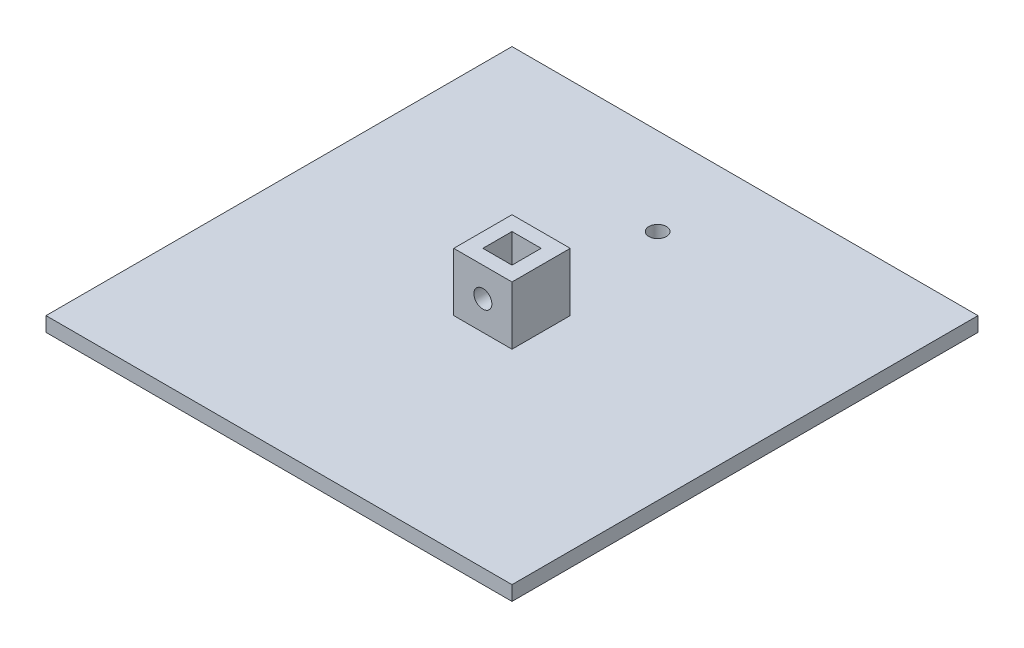
ISO-10303-21;
HEADER;
FILE_DESCRIPTION(('STEP AP214'),'2;1');
FILE_NAME('part.step','',(''),(''),'','','');
FILE_SCHEMA(('AUTOMOTIVE_DESIGN { 1 0 10303 214 1 1 1 1 }'));
ENDSEC;
DATA;
#1=APPLICATION_CONTEXT('core data for automotive mechanical design processes');
#2=APPLICATION_PROTOCOL_DEFINITION('international standard','automotive_design',2000,#1);
#3=PRODUCT_CONTEXT('',#1,'mechanical');
#4=PRODUCT('Part','Part','',(#3));
#5=PRODUCT_RELATED_PRODUCT_CATEGORY('part','',(#4));
#6=PRODUCT_DEFINITION_FORMATION('','',#4);
#7=PRODUCT_DEFINITION_CONTEXT('part definition',#1,'design');
#8=PRODUCT_DEFINITION('design','',#6,#7);
#9=PRODUCT_DEFINITION_SHAPE('','',#8);
#10=(LENGTH_UNIT() NAMED_UNIT(*) SI_UNIT(.MILLI.,.METRE.));
#11=(NAMED_UNIT(*) PLANE_ANGLE_UNIT() SI_UNIT($,.RADIAN.));
#12=(NAMED_UNIT(*) SI_UNIT($,.STERADIAN.) SOLID_ANGLE_UNIT());
#13=UNCERTAINTY_MEASURE_WITH_UNIT(LENGTH_MEASURE(1.E-05),#10,'distance_accuracy_value','');
#14=(GEOMETRIC_REPRESENTATION_CONTEXT(3) GLOBAL_UNCERTAINTY_ASSIGNED_CONTEXT((#13)) GLOBAL_UNIT_ASSIGNED_CONTEXT((#10,
#11,#12)) REPRESENTATION_CONTEXT('',''));
#15=CARTESIAN_POINT('',(0.,0.,0.));
#16=DIRECTION('',(0.,0.,1.));
#17=DIRECTION('',(1.,0.,0.));
#18=AXIS2_PLACEMENT_3D('',#15,#16,#17);
#19=CARTESIAN_POINT('',(0.,6.35,0.));
#20=DIRECTION('',(0.,1.,0.));
#21=DIRECTION('',(0.,0.,1.));
#22=AXIS2_PLACEMENT_3D('',#19,#20,#21);
#23=PLANE('',#22);
#24=CARTESIAN_POINT('',(0.,6.35,-63.5));
#25=DIRECTION('',(0.,1.,0.));
#26=DIRECTION('',(0.,0.,1.));
#27=AXIS2_PLACEMENT_3D('',#24,#25,#26);
#28=CIRCLE('',#27,3.81);
#29=CARTESIAN_POINT('',(0.,6.35,-59.69));
#30=VERTEX_POINT('',#29);
#31=EDGE_CURVE('E283',#30,#30,#28,.T.);
#32=ORIENTED_EDGE('',*,*,#31,.F.);
#33=EDGE_LOOP('',(#32));
#34=FACE_BOUND('',#33,.T.);
#35=DIRECTION('',(0.,0.,1.));
#36=VECTOR('',#35,1.);
#37=CARTESIAN_POINT('',(-101.6,6.35,101.6));
#38=LINE('',#37,#36);
#39=CARTESIAN_POINT('',(-101.6,6.35,-101.6));
#40=VERTEX_POINT('',#39);
#41=CARTESIAN_POINT('',(-101.6,6.35,101.6));
#42=VERTEX_POINT('',#41);
#43=EDGE_CURVE('E230',#40,#42,#38,.T.);
#44=ORIENTED_EDGE('',*,*,#43,.T.);
#45=DIRECTION('',(1.,0.,0.));
#46=VECTOR('',#45,1.);
#47=CARTESIAN_POINT('',(101.6,6.35,101.6));
#48=LINE('',#47,#46);
#49=CARTESIAN_POINT('',(101.6,6.35,101.6));
#50=VERTEX_POINT('',#49);
#51=EDGE_CURVE('E234',#42,#50,#48,.T.);
#52=ORIENTED_EDGE('',*,*,#51,.T.);
#53=DIRECTION('',(0.,0.,-1.));
#54=VECTOR('',#53,1.);
#55=CARTESIAN_POINT('',(101.6,6.35,101.6));
#56=LINE('',#55,#54);
#57=CARTESIAN_POINT('',(101.6,6.35,-101.6));
#58=VERTEX_POINT('',#57);
#59=EDGE_CURVE('E238',#50,#58,#56,.T.);
#60=ORIENTED_EDGE('',*,*,#59,.T.);
#61=DIRECTION('',(-1.,0.,0.));
#62=VECTOR('',#61,1.);
#63=CARTESIAN_POINT('',(101.6,6.35,-101.6));
#64=LINE('',#63,#62);
#65=EDGE_CURVE('E241',#58,#40,#64,.T.);
#66=ORIENTED_EDGE('',*,*,#65,.T.);
#67=EDGE_LOOP('',(#44,#52,#60,#66));
#68=FACE_BOUND('',#67,.T.);
#69=DIRECTION('',(1.,0.,0.));
#70=VECTOR('',#69,1.);
#71=CARTESIAN_POINT('',(0.,6.35,-12.7));
#72=LINE('',#71,#70);
#73=CARTESIAN_POINT('',(-12.7,6.35,-12.7));
#74=VERTEX_POINT('',#73);
#75=CARTESIAN_POINT('',(12.7,6.35,-12.7));
#76=VERTEX_POINT('',#75);
#77=EDGE_CURVE('E221',#74,#76,#72,.T.);
#78=ORIENTED_EDGE('',*,*,#77,.T.);
#79=DIRECTION('',(0.,0.,1.));
#80=VECTOR('',#79,1.);
#81=CARTESIAN_POINT('',(12.7,6.35,0.));
#82=LINE('',#81,#80);
#83=CARTESIAN_POINT('',(12.7,6.35,12.7));
#84=VERTEX_POINT('',#83);
#85=EDGE_CURVE('E225',#76,#84,#82,.T.);
#86=ORIENTED_EDGE('',*,*,#85,.T.);
#87=DIRECTION('',(-1.,0.,0.));
#88=VECTOR('',#87,1.);
#89=CARTESIAN_POINT('',(0.,6.35,12.7));
#90=LINE('',#89,#88);
#91=CARTESIAN_POINT('',(-12.7,6.35,12.7));
#92=VERTEX_POINT('',#91);
#93=EDGE_CURVE('E213',#84,#92,#90,.T.);
#94=ORIENTED_EDGE('',*,*,#93,.T.);
#95=DIRECTION('',(0.,0.,-1.));
#96=VECTOR('',#95,1.);
#97=CARTESIAN_POINT('',(-12.7,6.35,0.));
#98=LINE('',#97,#96);
#99=EDGE_CURVE('E217',#92,#74,#98,.T.);
#100=ORIENTED_EDGE('',*,*,#99,.T.);
#101=EDGE_LOOP('',(#78,#86,#94,#100));
#102=FACE_BOUND('',#101,.T.);
#103=ADVANCED_FACE('F38',(#34,#68,#102),#23,.T.);
#104=CARTESIAN_POINT('',(-101.6,6.35,101.6));
#105=DIRECTION('',(1.,0.,0.));
#106=DIRECTION('',(0.,0.,-1.));
#107=AXIS2_PLACEMENT_3D('',#104,#105,#106);
#108=PLANE('',#107);
#109=DIRECTION('',(0.,0.,1.));
#110=VECTOR('',#109,1.);
#111=CARTESIAN_POINT('',(-101.6,0.,101.6));
#112=LINE('',#111,#110);
#113=CARTESIAN_POINT('',(-101.6,0.,-101.6));
#114=VERTEX_POINT('',#113);
#115=CARTESIAN_POINT('',(-101.6,0.,101.6));
#116=VERTEX_POINT('',#115);
#117=EDGE_CURVE('E229',#114,#116,#112,.T.);
#118=ORIENTED_EDGE('',*,*,#117,.T.);
#119=DIRECTION('',(0.,-1.,0.));
#120=VECTOR('',#119,1.);
#121=CARTESIAN_POINT('',(-101.6,6.35,101.6));
#122=LINE('',#121,#120);
#123=EDGE_CURVE('E11',#42,#116,#122,.T.);
#124=ORIENTED_EDGE('',*,*,#123,.F.);
#125=ORIENTED_EDGE('',*,*,#43,.F.);
#126=DIRECTION('',(0.,-1.,0.));
#127=VECTOR('',#126,1.);
#128=CARTESIAN_POINT('',(-101.6,6.35,-101.6));
#129=LINE('',#128,#127);
#130=EDGE_CURVE('E244',#40,#114,#129,.T.);
#131=ORIENTED_EDGE('',*,*,#130,.T.);
#132=EDGE_LOOP('',(#118,#124,#125,#131));
#133=FACE_BOUND('',#132,.T.);
#134=ADVANCED_FACE('F40',(#133),#108,.F.);
#135=CARTESIAN_POINT('',(101.6,6.35,101.6));
#136=DIRECTION('',(0.,0.,-1.));
#137=DIRECTION('',(-1.,0.,0.));
#138=AXIS2_PLACEMENT_3D('',#135,#136,#137);
#139=PLANE('',#138);
#140=DIRECTION('',(1.,0.,0.));
#141=VECTOR('',#140,1.);
#142=CARTESIAN_POINT('',(101.6,0.,101.6));
#143=LINE('',#142,#141);
#144=CARTESIAN_POINT('',(101.6,0.,101.6));
#145=VERTEX_POINT('',#144);
#146=EDGE_CURVE('E248',#116,#145,#143,.T.);
#147=ORIENTED_EDGE('',*,*,#146,.T.);
#148=DIRECTION('',(0.,-1.,0.));
#149=VECTOR('',#148,1.);
#150=CARTESIAN_POINT('',(101.6,6.35,101.6));
#151=LINE('',#150,#149);
#152=EDGE_CURVE('E48',#50,#145,#151,.T.);
#153=ORIENTED_EDGE('',*,*,#152,.F.);
#154=ORIENTED_EDGE('',*,*,#51,.F.);
#155=ORIENTED_EDGE('',*,*,#123,.T.);
#156=EDGE_LOOP('',(#147,#153,#154,#155));
#157=FACE_BOUND('',#156,.T.);
#158=ADVANCED_FACE('F314',(#157),#139,.F.);
#159=CARTESIAN_POINT('',(101.6,6.35,101.6));
#160=DIRECTION('',(-1.,0.,0.));
#161=DIRECTION('',(0.,0.,1.));
#162=AXIS2_PLACEMENT_3D('',#159,#160,#161);
#163=PLANE('',#162);
#164=DIRECTION('',(0.,0.,-1.));
#165=VECTOR('',#164,1.);
#166=CARTESIAN_POINT('',(101.6,0.,101.6));
#167=LINE('',#166,#165);
#168=CARTESIAN_POINT('',(101.6,0.,-101.6));
#169=VERTEX_POINT('',#168);
#170=EDGE_CURVE('E251',#145,#169,#167,.T.);
#171=ORIENTED_EDGE('',*,*,#170,.T.);
#172=DIRECTION('',(0.,-1.,0.));
#173=VECTOR('',#172,1.);
#174=CARTESIAN_POINT('',(101.6,6.35,-101.6));
#175=LINE('',#174,#173);
#176=EDGE_CURVE('E259',#58,#169,#175,.T.);
#177=ORIENTED_EDGE('',*,*,#176,.F.);
#178=ORIENTED_EDGE('',*,*,#59,.F.);
#179=ORIENTED_EDGE('',*,*,#152,.T.);
#180=EDGE_LOOP('',(#171,#177,#178,#179));
#181=FACE_BOUND('',#180,.T.);
#182=ADVANCED_FACE('F434',(#181),#163,.F.);
#183=CARTESIAN_POINT('',(101.6,6.35,-101.6));
#184=DIRECTION('',(0.,0.,1.));
#185=DIRECTION('',(1.,0.,0.));
#186=AXIS2_PLACEMENT_3D('',#183,#184,#185);
#187=PLANE('',#186);
#188=DIRECTION('',(-1.,0.,0.));
#189=VECTOR('',#188,1.);
#190=CARTESIAN_POINT('',(101.6,0.,-101.6));
#191=LINE('',#190,#189);
#192=EDGE_CURVE('E235',#169,#114,#191,.T.);
#193=ORIENTED_EDGE('',*,*,#192,.T.);
#194=ORIENTED_EDGE('',*,*,#130,.F.);
#195=ORIENTED_EDGE('',*,*,#65,.F.);
#196=ORIENTED_EDGE('',*,*,#176,.T.);
#197=EDGE_LOOP('',(#193,#194,#195,#196));
#198=FACE_BOUND('',#197,.T.);
#199=ADVANCED_FACE('F403',(#198),#187,.F.);
#200=CARTESIAN_POINT('',(0.,0.,0.));
#201=DIRECTION('',(0.,1.,0.));
#202=DIRECTION('',(0.,0.,1.));
#203=AXIS2_PLACEMENT_3D('',#200,#201,#202);
#204=PLANE('',#203);
#205=CARTESIAN_POINT('',(0.,0.,-63.5));
#206=DIRECTION('',(0.,1.,0.));
#207=DIRECTION('',(0.,0.,1.));
#208=AXIS2_PLACEMENT_3D('',#205,#206,#207);
#209=CIRCLE('',#208,3.81);
#210=CARTESIAN_POINT('',(0.,0.,-59.69));
#211=VERTEX_POINT('',#210);
#212=EDGE_CURVE('E42',#211,#211,#209,.T.);
#213=ORIENTED_EDGE('',*,*,#212,.T.);
#214=EDGE_LOOP('',(#213));
#215=FACE_BOUND('',#214,.T.);
#216=ORIENTED_EDGE('',*,*,#117,.F.);
#217=ORIENTED_EDGE('',*,*,#192,.F.);
#218=ORIENTED_EDGE('',*,*,#170,.F.);
#219=ORIENTED_EDGE('',*,*,#146,.F.);
#220=EDGE_LOOP('',(#216,#217,#218,#219));
#221=FACE_BOUND('',#220,.T.);
#222=ADVANCED_FACE('F292',(#215,#221),#204,.F.);
#223=CARTESIAN_POINT('',(0.,31.75,0.));
#224=DIRECTION('',(0.,-1.,0.));
#225=DIRECTION('',(0.,0.,-1.));
#226=AXIS2_PLACEMENT_3D('',#223,#224,#225);
#227=PLANE('',#226);
#228=DIRECTION('',(0.,0.,-1.));
#229=VECTOR('',#228,1.);
#230=CARTESIAN_POINT('',(12.7,31.75,12.7));
#231=LINE('',#230,#229);
#232=CARTESIAN_POINT('',(12.7,31.75,12.7));
#233=VERTEX_POINT('',#232);
#234=CARTESIAN_POINT('',(12.7,31.75,-12.7));
#235=VERTEX_POINT('',#234);
#236=EDGE_CURVE('E151',#233,#235,#231,.T.);
#237=ORIENTED_EDGE('',*,*,#236,.T.);
#238=DIRECTION('',(-1.,0.,0.));
#239=VECTOR('',#238,1.);
#240=CARTESIAN_POINT('',(-12.7,31.75,-12.7));
#241=LINE('',#240,#239);
#242=CARTESIAN_POINT('',(-12.7,31.75,-12.7));
#243=VERTEX_POINT('',#242);
#244=EDGE_CURVE('E178',#235,#243,#241,.T.);
#245=ORIENTED_EDGE('',*,*,#244,.T.);
#246=DIRECTION('',(0.,0.,1.));
#247=VECTOR('',#246,1.);
#248=CARTESIAN_POINT('',(-12.7,31.75,12.7));
#249=LINE('',#248,#247);
#250=CARTESIAN_POINT('',(-12.7,31.75,12.7));
#251=VERTEX_POINT('',#250);
#252=EDGE_CURVE('E181',#243,#251,#249,.T.);
#253=ORIENTED_EDGE('',*,*,#252,.T.);
#254=DIRECTION('',(1.,0.,0.));
#255=VECTOR('',#254,1.);
#256=CARTESIAN_POINT('',(-12.7,31.75,12.7));
#257=LINE('',#256,#255);
#258=EDGE_CURVE('E184',#251,#233,#257,.T.);
#259=ORIENTED_EDGE('',*,*,#258,.T.);
#260=EDGE_LOOP('',(#237,#245,#253,#259));
#261=FACE_BOUND('',#260,.T.);
#262=DIRECTION('',(0.,0.,-1.));
#263=VECTOR('',#262,1.);
#264=CARTESIAN_POINT('',(6.35,31.75,6.35));
#265=LINE('',#264,#263);
#266=CARTESIAN_POINT('',(6.35,31.75,6.35));
#267=VERTEX_POINT('',#266);
#268=CARTESIAN_POINT('',(6.35,31.75,-6.35));
#269=VERTEX_POINT('',#268);
#270=EDGE_CURVE('E132',#267,#269,#265,.T.);
#271=ORIENTED_EDGE('',*,*,#270,.F.);
#272=DIRECTION('',(1.,0.,0.));
#273=VECTOR('',#272,1.);
#274=CARTESIAN_POINT('',(-6.35,31.75,6.35));
#275=LINE('',#274,#273);
#276=CARTESIAN_POINT('',(-6.35,31.75,6.35));
#277=VERTEX_POINT('',#276);
#278=EDGE_CURVE('E161',#277,#267,#275,.T.);
#279=ORIENTED_EDGE('',*,*,#278,.F.);
#280=DIRECTION('',(0.,0.,1.));
#281=VECTOR('',#280,1.);
#282=CARTESIAN_POINT('',(-6.35,31.75,6.35));
#283=LINE('',#282,#281);
#284=CARTESIAN_POINT('',(-6.35,31.75,-6.35));
#285=VERTEX_POINT('',#284);
#286=EDGE_CURVE('E157',#285,#277,#283,.T.);
#287=ORIENTED_EDGE('',*,*,#286,.F.);
#288=DIRECTION('',(-1.,0.,0.));
#289=VECTOR('',#288,1.);
#290=CARTESIAN_POINT('',(-6.35,31.75,-6.35));
#291=LINE('',#290,#289);
#292=EDGE_CURVE('E142',#269,#285,#291,.T.);
#293=ORIENTED_EDGE('',*,*,#292,.F.);
#294=EDGE_LOOP('',(#271,#279,#287,#293));
#295=FACE_BOUND('',#294,.T.);
#296=ADVANCED_FACE('F155',(#261,#295),#227,.F.);
#297=CARTESIAN_POINT('',(12.7,31.75,12.7));
#298=DIRECTION('',(-1.,0.,0.));
#299=DIRECTION('',(0.,0.,1.));
#300=AXIS2_PLACEMENT_3D('',#297,#298,#299);
#301=PLANE('',#300);
#302=ORIENTED_EDGE('',*,*,#85,.F.);
#303=DIRECTION('',(0.,-1.,0.));
#304=VECTOR('',#303,1.);
#305=CARTESIAN_POINT('',(12.7,31.75,-12.7));
#306=LINE('',#305,#304);
#307=EDGE_CURVE('E197',#235,#76,#306,.T.);
#308=ORIENTED_EDGE('',*,*,#307,.F.);
#309=ORIENTED_EDGE('',*,*,#236,.F.);
#310=DIRECTION('',(0.,-1.,0.));
#311=VECTOR('',#310,1.);
#312=CARTESIAN_POINT('',(12.7,31.75,12.7));
#313=LINE('',#312,#311);
#314=EDGE_CURVE('E187',#233,#84,#313,.T.);
#315=ORIENTED_EDGE('',*,*,#314,.T.);
#316=EDGE_LOOP('',(#302,#308,#309,#315));
#317=FACE_BOUND('',#316,.T.);
#318=ADVANCED_FACE('F343',(#317),#301,.F.);
#319=CARTESIAN_POINT('',(-12.7,31.75,-12.7));
#320=DIRECTION('',(0.,0.,1.));
#321=DIRECTION('',(1.,0.,0.));
#322=AXIS2_PLACEMENT_3D('',#319,#320,#321);
#323=PLANE('',#322);
#324=CARTESIAN_POINT('',(0.,19.05,-12.7));
#325=DIRECTION('',(0.,0.,1.));
#326=DIRECTION('',(1.,0.,0.));
#327=AXIS2_PLACEMENT_3D('',#324,#325,#326);
#328=CIRCLE('',#327,3.90628738414119);
#329=CARTESIAN_POINT('',(3.90628738414119,19.05,-12.7));
#330=VERTEX_POINT('',#329);
#331=EDGE_CURVE('E268',#330,#330,#328,.T.);
#332=ORIENTED_EDGE('',*,*,#331,.T.);
#333=EDGE_LOOP('',(#332));
#334=FACE_BOUND('',#333,.T.);
#335=ORIENTED_EDGE('',*,*,#77,.F.);
#336=DIRECTION('',(0.,-1.,0.));
#337=VECTOR('',#336,1.);
#338=CARTESIAN_POINT('',(-12.7,31.75,-12.7));
#339=LINE('',#338,#337);
#340=EDGE_CURVE('E193',#243,#74,#339,.T.);
#341=ORIENTED_EDGE('',*,*,#340,.F.);
#342=ORIENTED_EDGE('',*,*,#244,.F.);
#343=ORIENTED_EDGE('',*,*,#307,.T.);
#344=EDGE_LOOP('',(#335,#341,#342,#343));
#345=FACE_BOUND('',#344,.T.);
#346=ADVANCED_FACE('F351',(#334,#345),#323,.F.);
#347=CARTESIAN_POINT('',(-12.7,31.75,12.7));
#348=DIRECTION('',(1.,0.,0.));
#349=DIRECTION('',(0.,0.,-1.));
#350=AXIS2_PLACEMENT_3D('',#347,#348,#349);
#351=PLANE('',#350);
#352=ORIENTED_EDGE('',*,*,#99,.F.);
#353=DIRECTION('',(0.,-1.,0.));
#354=VECTOR('',#353,1.);
#355=CARTESIAN_POINT('',(-12.7,31.75,12.7));
#356=LINE('',#355,#354);
#357=EDGE_CURVE('E56',#251,#92,#356,.T.);
#358=ORIENTED_EDGE('',*,*,#357,.F.);
#359=ORIENTED_EDGE('',*,*,#252,.F.);
#360=ORIENTED_EDGE('',*,*,#340,.T.);
#361=EDGE_LOOP('',(#352,#358,#359,#360));
#362=FACE_BOUND('',#361,.T.);
#363=ADVANCED_FACE('F347',(#362),#351,.F.);
#364=CARTESIAN_POINT('',(-12.7,31.75,12.7));
#365=DIRECTION('',(0.,0.,-1.));
#366=DIRECTION('',(-1.,0.,0.));
#367=AXIS2_PLACEMENT_3D('',#364,#365,#366);
#368=PLANE('',#367);
#369=CARTESIAN_POINT('',(0.,19.05,12.7));
#370=DIRECTION('',(0.,0.,1.));
#371=DIRECTION('',(1.,0.,0.));
#372=AXIS2_PLACEMENT_3D('',#369,#370,#371);
#373=CIRCLE('',#372,3.90628738414119);
#374=CARTESIAN_POINT('',(3.90628738414119,19.05,12.7));
#375=VERTEX_POINT('',#374);
#376=EDGE_CURVE('E275',#375,#375,#373,.T.);
#377=ORIENTED_EDGE('',*,*,#376,.F.);
#378=EDGE_LOOP('',(#377));
#379=FACE_BOUND('',#378,.T.);
#380=ORIENTED_EDGE('',*,*,#93,.F.);
#381=ORIENTED_EDGE('',*,*,#314,.F.);
#382=ORIENTED_EDGE('',*,*,#258,.F.);
#383=ORIENTED_EDGE('',*,*,#357,.T.);
#384=EDGE_LOOP('',(#380,#381,#382,#383));
#385=FACE_BOUND('',#384,.T.);
#386=ADVANCED_FACE('F340',(#379,#385),#368,.F.);
#387=CARTESIAN_POINT('',(6.35,31.75,6.35));
#388=DIRECTION('',(-1.,0.,0.));
#389=DIRECTION('',(0.,0.,1.));
#390=AXIS2_PLACEMENT_3D('',#387,#388,#389);
#391=PLANE('',#390);
#392=DIRECTION('',(0.,-1.,0.));
#393=VECTOR('',#392,1.);
#394=CARTESIAN_POINT('',(6.35,31.75,-6.35));
#395=LINE('',#394,#393);
#396=CARTESIAN_POINT('',(6.35,6.35,-6.35));
#397=VERTEX_POINT('',#396);
#398=EDGE_CURVE('E135',#269,#397,#395,.T.);
#399=ORIENTED_EDGE('',*,*,#398,.T.);
#400=DIRECTION('',(0.,0.,1.));
#401=VECTOR('',#400,1.);
#402=CARTESIAN_POINT('',(6.35,6.35,0.));
#403=LINE('',#402,#401);
#404=CARTESIAN_POINT('',(6.35,6.35,6.35));
#405=VERTEX_POINT('',#404);
#406=EDGE_CURVE('E64',#397,#405,#403,.T.);
#407=ORIENTED_EDGE('',*,*,#406,.T.);
#408=DIRECTION('',(0.,-1.,0.));
#409=VECTOR('',#408,1.);
#410=CARTESIAN_POINT('',(6.35,31.75,6.35));
#411=LINE('',#410,#409);
#412=EDGE_CURVE('E137',#267,#405,#411,.T.);
#413=ORIENTED_EDGE('',*,*,#412,.F.);
#414=ORIENTED_EDGE('',*,*,#270,.T.);
#415=EDGE_LOOP('',(#399,#407,#413,#414));
#416=FACE_BOUND('',#415,.T.);
#417=ADVANCED_FACE('F134',(#416),#391,.T.);
#418=CARTESIAN_POINT('',(-6.35,31.75,-6.35));
#419=DIRECTION('',(0.,0.,1.));
#420=DIRECTION('',(1.,0.,0.));
#421=AXIS2_PLACEMENT_3D('',#418,#419,#420);
#422=PLANE('',#421);
#423=CARTESIAN_POINT('',(0.,19.05,-6.35));
#424=DIRECTION('',(0.,0.,1.));
#425=DIRECTION('',(1.,0.,0.));
#426=AXIS2_PLACEMENT_3D('',#423,#424,#425);
#427=CIRCLE('',#426,3.90628738414119);
#428=CARTESIAN_POINT('',(3.90628738414119,19.05,-6.35));
#429=VERTEX_POINT('',#428);
#430=EDGE_CURVE('E143',#429,#429,#427,.T.);
#431=ORIENTED_EDGE('',*,*,#430,.F.);
#432=EDGE_LOOP('',(#431));
#433=FACE_BOUND('',#432,.T.);
#434=DIRECTION('',(0.,-1.,0.));
#435=VECTOR('',#434,1.);
#436=CARTESIAN_POINT('',(-6.35,31.75,-6.35));
#437=LINE('',#436,#435);
#438=CARTESIAN_POINT('',(-6.35,6.35,-6.35));
#439=VERTEX_POINT('',#438);
#440=EDGE_CURVE('E152',#285,#439,#437,.T.);
#441=ORIENTED_EDGE('',*,*,#440,.T.);
#442=DIRECTION('',(1.,0.,0.));
#443=VECTOR('',#442,1.);
#444=CARTESIAN_POINT('',(0.,6.35,-6.35));
#445=LINE('',#444,#443);
#446=EDGE_CURVE('E149',#439,#397,#445,.T.);
#447=ORIENTED_EDGE('',*,*,#446,.T.);
#448=ORIENTED_EDGE('',*,*,#398,.F.);
#449=ORIENTED_EDGE('',*,*,#292,.T.);
#450=EDGE_LOOP('',(#441,#447,#448,#449));
#451=FACE_BOUND('',#450,.T.);
#452=ADVANCED_FACE('F147',(#433,#451),#422,.T.);
#453=CARTESIAN_POINT('',(-6.35,31.75,6.35));
#454=DIRECTION('',(1.,0.,0.));
#455=DIRECTION('',(0.,0.,-1.));
#456=AXIS2_PLACEMENT_3D('',#453,#454,#455);
#457=PLANE('',#456);
#458=DIRECTION('',(0.,-1.,0.));
#459=VECTOR('',#458,1.);
#460=CARTESIAN_POINT('',(-6.35,31.75,6.35));
#461=LINE('',#460,#459);
#462=CARTESIAN_POINT('',(-6.35,6.35,6.35));
#463=VERTEX_POINT('',#462);
#464=EDGE_CURVE('E169',#277,#463,#461,.T.);
#465=ORIENTED_EDGE('',*,*,#464,.T.);
#466=DIRECTION('',(0.,0.,-1.));
#467=VECTOR('',#466,1.);
#468=CARTESIAN_POINT('',(-6.35,6.35,0.));
#469=LINE('',#468,#467);
#470=EDGE_CURVE('E205',#463,#439,#469,.T.);
#471=ORIENTED_EDGE('',*,*,#470,.T.);
#472=ORIENTED_EDGE('',*,*,#440,.F.);
#473=ORIENTED_EDGE('',*,*,#286,.T.);
#474=EDGE_LOOP('',(#465,#471,#472,#473));
#475=FACE_BOUND('',#474,.T.);
#476=ADVANCED_FACE('F325',(#475),#457,.T.);
#477=CARTESIAN_POINT('',(-6.35,31.75,6.35));
#478=DIRECTION('',(0.,0.,-1.));
#479=DIRECTION('',(-1.,0.,0.));
#480=AXIS2_PLACEMENT_3D('',#477,#478,#479);
#481=PLANE('',#480);
#482=CARTESIAN_POINT('',(0.,19.05,6.35));
#483=DIRECTION('',(0.,0.,-1.));
#484=DIRECTION('',(-1.,0.,0.));
#485=AXIS2_PLACEMENT_3D('',#482,#483,#484);
#486=CIRCLE('',#485,3.90628738414119);
#487=CARTESIAN_POINT('',(-3.90628738414119,19.05,6.35));
#488=VERTEX_POINT('',#487);
#489=EDGE_CURVE('E265',#488,#488,#486,.T.);
#490=ORIENTED_EDGE('',*,*,#489,.F.);
#491=EDGE_LOOP('',(#490));
#492=FACE_BOUND('',#491,.T.);
#493=ORIENTED_EDGE('',*,*,#412,.T.);
#494=DIRECTION('',(-1.,0.,0.));
#495=VECTOR('',#494,1.);
#496=CARTESIAN_POINT('',(0.,6.35,6.35));
#497=LINE('',#496,#495);
#498=EDGE_CURVE('E201',#405,#463,#497,.T.);
#499=ORIENTED_EDGE('',*,*,#498,.T.);
#500=ORIENTED_EDGE('',*,*,#464,.F.);
#501=ORIENTED_EDGE('',*,*,#278,.T.);
#502=EDGE_LOOP('',(#493,#499,#500,#501));
#503=FACE_BOUND('',#502,.T.);
#504=ADVANCED_FACE('F320',(#492,#503),#481,.T.);
#505=ORIENTED_EDGE('',*,*,#406,.F.);
#506=ORIENTED_EDGE('',*,*,#446,.F.);
#507=ORIENTED_EDGE('',*,*,#470,.F.);
#508=ORIENTED_EDGE('',*,*,#498,.F.);
#509=EDGE_LOOP('',(#505,#506,#507,#508));
#510=FACE_BOUND('',#509,.T.);
#511=ADVANCED_FACE('F308',(#510),#23,.T.);
#512=CARTESIAN_POINT('',(0.,19.05,-12.7));
#513=DIRECTION('',(0.,0.,1.));
#514=DIRECTION('',(1.,0.,0.));
#515=AXIS2_PLACEMENT_3D('',#512,#513,#514);
#516=CYLINDRICAL_SURFACE('',#515,3.90628738414119);
#517=ORIENTED_EDGE('',*,*,#489,.T.);
#518=EDGE_LOOP('',(#517));
#519=FACE_BOUND('',#518,.T.);
#520=ORIENTED_EDGE('',*,*,#376,.T.);
#521=EDGE_LOOP('',(#520));
#522=FACE_BOUND('',#521,.T.);
#523=ADVANCED_FACE('F302',(#519,#522),#516,.F.);
#524=ORIENTED_EDGE('',*,*,#430,.T.);
#525=EDGE_LOOP('',(#524));
#526=FACE_BOUND('',#525,.T.);
#527=ORIENTED_EDGE('',*,*,#331,.F.);
#528=EDGE_LOOP('',(#527));
#529=FACE_BOUND('',#528,.T.);
#530=ADVANCED_FACE('F297',(#526,#529),#516,.F.);
#531=CARTESIAN_POINT('',(0.,-19.05,-63.5));
#532=DIRECTION('',(0.,1.,0.));
#533=DIRECTION('',(0.,0.,1.));
#534=AXIS2_PLACEMENT_3D('',#531,#532,#533);
#535=CYLINDRICAL_SURFACE('',#534,3.81);
#536=ORIENTED_EDGE('',*,*,#31,.T.);
#537=EDGE_LOOP('',(#536));
#538=FACE_BOUND('',#537,.T.);
#539=ORIENTED_EDGE('',*,*,#212,.F.);
#540=EDGE_LOOP('',(#539));
#541=FACE_BOUND('',#540,.T.);
#542=ADVANCED_FACE('F295',(#538,#541),#535,.F.);
#543=CLOSED_SHELL('',(#103,#134,#158,#182,#199,#222,#296,#318,#346,#363,#386,#417,#452,#476,
#504,#511,#523,#530,#542));
#544=MANIFOLD_SOLID_BREP('B2',#543);
#545=ADVANCED_BREP_SHAPE_REPRESENTATION('',(#18,#544),#14);
#546=SHAPE_DEFINITION_REPRESENTATION(#9,#545);
ENDSEC;
END-ISO-10303-21;
